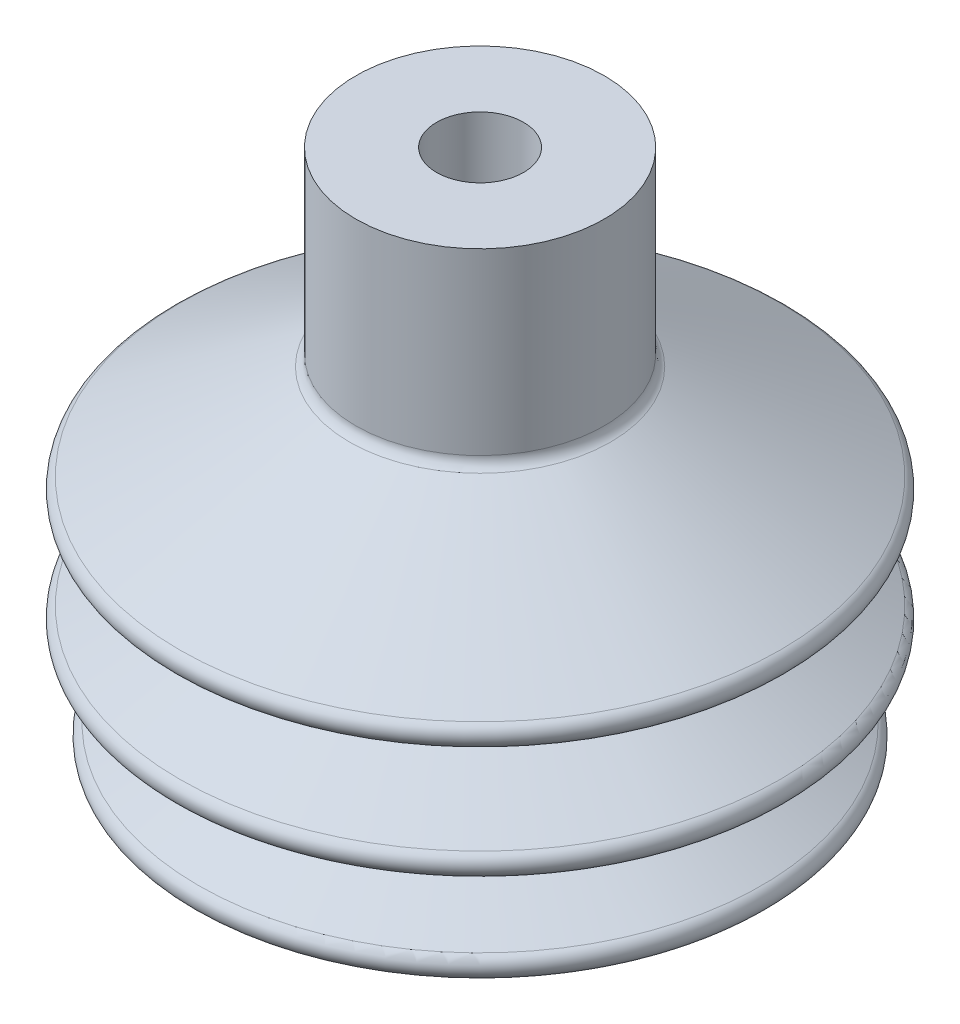
ISO-10303-21;
HEADER;
FILE_DESCRIPTION(('STEP AP214'),'2;1');
FILE_NAME('part.step','',(''),(''),'','','');
FILE_SCHEMA(('AUTOMOTIVE_DESIGN { 1 0 10303 214 1 1 1 1 }'));
ENDSEC;
DATA;
#1=APPLICATION_CONTEXT('core data for automotive mechanical design processes');
#2=APPLICATION_PROTOCOL_DEFINITION('international standard','automotive_design',2000,#1);
#3=PRODUCT_CONTEXT('',#1,'mechanical');
#4=PRODUCT('Part','Part','',(#3));
#5=PRODUCT_RELATED_PRODUCT_CATEGORY('part','',(#4));
#6=PRODUCT_DEFINITION_FORMATION('','',#4);
#7=PRODUCT_DEFINITION_CONTEXT('part definition',#1,'design');
#8=PRODUCT_DEFINITION('design','',#6,#7);
#9=PRODUCT_DEFINITION_SHAPE('','',#8);
#10=(LENGTH_UNIT() NAMED_UNIT(*) SI_UNIT(.MILLI.,.METRE.));
#11=(NAMED_UNIT(*) PLANE_ANGLE_UNIT() SI_UNIT($,.RADIAN.));
#12=(NAMED_UNIT(*) SI_UNIT($,.STERADIAN.) SOLID_ANGLE_UNIT());
#13=UNCERTAINTY_MEASURE_WITH_UNIT(LENGTH_MEASURE(1.E-05),#10,'distance_accuracy_value','');
#14=(GEOMETRIC_REPRESENTATION_CONTEXT(3) GLOBAL_UNCERTAINTY_ASSIGNED_CONTEXT((#13)) GLOBAL_UNIT_ASSIGNED_CONTEXT((#10,
#11,#12)) REPRESENTATION_CONTEXT('',''));
#15=CARTESIAN_POINT('',(0.,0.,0.));
#16=DIRECTION('',(0.,0.,1.));
#17=DIRECTION('',(1.,0.,0.));
#18=AXIS2_PLACEMENT_3D('',#15,#16,#17);
#19=CARTESIAN_POINT('',(0.,0.,0.));
#20=DIRECTION('',(0.,1.,0.));
#21=DIRECTION('',(0.,0.,1.));
#22=AXIS2_PLACEMENT_3D('',#19,#20,#21);
#23=PLANE('',#22);
#24=CARTESIAN_POINT('',(0.,0.,0.));
#25=DIRECTION('',(0.,1.,0.));
#26=DIRECTION('',(0.,0.,1.));
#27=AXIS2_PLACEMENT_3D('',#24,#25,#26);
#28=CIRCLE('',#27,3.5);
#29=CARTESIAN_POINT('',(0.,0.,3.5));
#30=VERTEX_POINT('',#29);
#31=EDGE_CURVE('E82',#30,#30,#28,.T.);
#32=ORIENTED_EDGE('',*,*,#31,.T.);
#33=EDGE_LOOP('',(#32));
#34=FACE_BOUND('',#33,.T.);
#35=CARTESIAN_POINT('',(0.,0.,0.));
#36=DIRECTION('',(0.,-1.,0.));
#37=DIRECTION('',(0.,0.,-1.));
#38=AXIS2_PLACEMENT_3D('',#35,#36,#37);
#39=CIRCLE('',#38,5.90880915825541);
#40=CARTESIAN_POINT('',(0.,0.,-5.90880915825541));
#41=VERTEX_POINT('',#40);
#42=EDGE_CURVE('E117',#41,#41,#39,.T.);
#43=ORIENTED_EDGE('',*,*,#42,.T.);
#44=EDGE_LOOP('',(#43));
#45=FACE_BOUND('',#44,.T.);
#46=ADVANCED_FACE('F37',(#34,#45),#23,.F.);
#47=CARTESIAN_POINT('',(0.,15.,0.));
#48=DIRECTION('',(0.,1.,0.));
#49=DIRECTION('',(0.,0.,1.));
#50=AXIS2_PLACEMENT_3D('',#47,#48,#49);
#51=PLANE('',#50);
#52=CARTESIAN_POINT('',(0.,15.,0.));
#53=DIRECTION('',(0.,1.,0.));
#54=DIRECTION('',(0.,0.,1.));
#55=AXIS2_PLACEMENT_3D('',#52,#53,#54);
#56=CIRCLE('',#55,10.);
#57=CARTESIAN_POINT('',(0.,15.,10.));
#58=VERTEX_POINT('',#57);
#59=EDGE_CURVE('E77',#58,#58,#56,.T.);
#60=ORIENTED_EDGE('',*,*,#59,.T.);
#61=EDGE_LOOP('',(#60));
#62=FACE_BOUND('',#61,.T.);
#63=CARTESIAN_POINT('',(0.,15.,0.));
#64=DIRECTION('',(0.,1.,0.));
#65=DIRECTION('',(0.,0.,1.));
#66=AXIS2_PLACEMENT_3D('',#63,#64,#65);
#67=CIRCLE('',#66,3.5);
#68=CARTESIAN_POINT('',(0.,15.,3.5));
#69=VERTEX_POINT('',#68);
#70=EDGE_CURVE('E81',#69,#69,#67,.T.);
#71=ORIENTED_EDGE('',*,*,#70,.F.);
#72=EDGE_LOOP('',(#71));
#73=FACE_BOUND('',#72,.T.);
#74=ADVANCED_FACE('F140',(#62,#73),#51,.T.);
#75=CARTESIAN_POINT('',(0.,15.,0.));
#76=DIRECTION('',(0.,-1.,0.));
#77=DIRECTION('',(0.,0.,-1.));
#78=AXIS2_PLACEMENT_3D('',#75,#76,#77);
#79=CYLINDRICAL_SURFACE('',#78,10.);
#80=CARTESIAN_POINT('',(0.,0.585929994802857,0.));
#81=DIRECTION('',(0.,-1.,0.));
#82=DIRECTION('',(0.,0.,-1.));
#83=AXIS2_PLACEMENT_3D('',#80,#81,#82);
#84=CIRCLE('',#83,10.);
#85=CARTESIAN_POINT('',(0.,0.585929994802857,-10.));
#86=VERTEX_POINT('',#85);
#87=EDGE_CURVE('E65',#86,#86,#84,.F.);
#88=ORIENTED_EDGE('',*,*,#87,.T.);
#89=EDGE_LOOP('',(#88));
#90=FACE_BOUND('',#89,.T.);
#91=ORIENTED_EDGE('',*,*,#59,.F.);
#92=EDGE_LOOP('',(#91));
#93=FACE_BOUND('',#92,.T.);
#94=ADVANCED_FACE('F146',(#90,#93),#79,.T.);
#95=CARTESIAN_POINT('',(0.,15.,0.));
#96=DIRECTION('',(0.,-1.,0.));
#97=DIRECTION('',(0.,0.,-1.));
#98=AXIS2_PLACEMENT_3D('',#95,#96,#97);
#99=CYLINDRICAL_SURFACE('',#98,3.5);
#100=ORIENTED_EDGE('',*,*,#70,.T.);
#101=EDGE_LOOP('',(#100));
#102=FACE_BOUND('',#101,.T.);
#103=ORIENTED_EDGE('',*,*,#31,.F.);
#104=EDGE_LOOP('',(#103));
#105=FACE_BOUND('',#104,.T.);
#106=ADVANCED_FACE('F152',(#102,#105),#99,.F.);
#107=CARTESIAN_POINT('',(0.,-8.96606826091942,0.));
#108=DIRECTION('',(0.,-1.,0.));
#109=DIRECTION('',(0.,0.,-1.));
#110=AXIS2_PLACEMENT_3D('',#107,#108,#109);
#111=CONICAL_SURFACE('',#110,26.,1.06001932873222);
#112=CARTESIAN_POINT('',(0.,-0.286434936656735,0.));
#113=DIRECTION('',(0.,1.,0.));
#114=DIRECTION('',(0.,0.,1.));
#115=AXIS2_PLACEMENT_3D('',#112,#113,#114);
#116=CIRCLE('',#115,10.5111447797563);
#117=CARTESIAN_POINT('',(0.,-0.286434936656735,10.5111447797563));
#118=VERTEX_POINT('',#117);
#119=EDGE_CURVE('E69',#118,#118,#116,.F.);
#120=ORIENTED_EDGE('',*,*,#119,.T.);
#121=EDGE_LOOP('',(#120));
#122=FACE_BOUND('',#121,.T.);
#123=CARTESIAN_POINT('',(0.,-7.94426354758497,0.));
#124=DIRECTION('',(0.,1.,0.));
#125=DIRECTION('',(0.,0.,1.));
#126=AXIS2_PLACEMENT_3D('',#123,#124,#125);
#127=CIRCLE('',#126,24.1765836554456);
#128=CARTESIAN_POINT('',(0.,-7.94426354758497,24.1765836554456));
#129=VERTEX_POINT('',#128);
#130=EDGE_CURVE('E73',#129,#129,#127,.T.);
#131=ORIENTED_EDGE('',*,*,#130,.T.);
#132=EDGE_LOOP('',(#131));
#133=FACE_BOUND('',#132,.T.);
#134=ADVANCED_FACE('F192',(#122,#133),#111,.T.);
#135=CARTESIAN_POINT('',(0.,-12.7292224881256,0.));
#136=DIRECTION('',(0.,1.,0.));
#137=DIRECTION('',(0.,0.,1.));
#138=AXIS2_PLACEMENT_3D('',#135,#136,#137);
#139=CONICAL_SURFACE('',#138,16.6245431295963,1.18909779745228);
#140=CARTESIAN_POINT('',(0.,-9.74466175602362,0.));
#141=DIRECTION('',(0.,-1.,0.));
#142=DIRECTION('',(0.,0.,-1.));
#143=AXIS2_PLACEMENT_3D('',#140,#141,#142);
#144=CIRCLE('',#143,24.0602257329364);
#145=CARTESIAN_POINT('',(0.,-9.74466175602362,-24.0602257329364));
#146=VERTEX_POINT('',#145);
#147=EDGE_CURVE('E10',#146,#146,#144,.T.);
#148=ORIENTED_EDGE('',*,*,#147,.T.);
#149=EDGE_LOOP('',(#148));
#150=FACE_BOUND('',#149,.T.);
#151=CARTESIAN_POINT('',(0.,-12.7292224881256,0.));
#152=DIRECTION('',(0.,-1.,0.));
#153=DIRECTION('',(0.,0.,-1.));
#154=AXIS2_PLACEMENT_3D('',#151,#152,#153);
#155=CIRCLE('',#154,16.6245431295963);
#156=CARTESIAN_POINT('',(0.,-12.7292224881256,-16.6245431295963));
#157=VERTEX_POINT('',#156);
#158=EDGE_CURVE('E86',#157,#157,#155,.T.);
#159=ORIENTED_EDGE('',*,*,#158,.F.);
#160=EDGE_LOOP('',(#159));
#161=FACE_BOUND('',#160,.T.);
#162=ADVANCED_FACE('F189',(#150,#161),#139,.T.);
#163=CARTESIAN_POINT('',(0.,-17.9830341304597,0.));
#164=DIRECTION('',(0.,-1.,0.));
#165=DIRECTION('',(0.,0.,-1.));
#166=AXIS2_PLACEMENT_3D('',#163,#164,#165);
#167=CONICAL_SURFACE('',#166,26.,1.06001932873222);
#168=CARTESIAN_POINT('',(0.,-16.9612294171253,0.));
#169=DIRECTION('',(0.,1.,0.));
#170=DIRECTION('',(0.,0.,1.));
#171=AXIS2_PLACEMENT_3D('',#168,#169,#170);
#172=CIRCLE('',#171,24.1765836554456);
#173=CARTESIAN_POINT('',(0.,-16.9612294171253,24.1765836554456));
#174=VERTEX_POINT('',#173);
#175=EDGE_CURVE('E45',#174,#174,#172,.T.);
#176=ORIENTED_EDGE('',*,*,#175,.T.);
#177=EDGE_LOOP('',(#176));
#178=FACE_BOUND('',#177,.T.);
#179=ORIENTED_EDGE('',*,*,#158,.T.);
#180=EDGE_LOOP('',(#179));
#181=FACE_BOUND('',#180,.T.);
#182=ADVANCED_FACE('F171',(#178,#181),#167,.T.);
#183=CARTESIAN_POINT('',(0.,-21.7461883576659,0.));
#184=DIRECTION('',(0.,1.,0.));
#185=DIRECTION('',(0.,0.,1.));
#186=AXIS2_PLACEMENT_3D('',#183,#184,#185);
#187=CONICAL_SURFACE('',#186,16.6245431295963,1.18909779745228);
#188=CARTESIAN_POINT('',(0.,-18.7616276255639,0.));
#189=DIRECTION('',(0.,-1.,0.));
#190=DIRECTION('',(0.,0.,-1.));
#191=AXIS2_PLACEMENT_3D('',#188,#189,#190);
#192=CIRCLE('',#191,24.0602257329364);
#193=CARTESIAN_POINT('',(0.,-18.7616276255639,-24.0602257329364));
#194=VERTEX_POINT('',#193);
#195=EDGE_CURVE('E50',#194,#194,#192,.T.);
#196=ORIENTED_EDGE('',*,*,#195,.T.);
#197=EDGE_LOOP('',(#196));
#198=FACE_BOUND('',#197,.T.);
#199=CARTESIAN_POINT('',(0.,-21.7461883576659,0.));
#200=DIRECTION('',(0.,-1.,0.));
#201=DIRECTION('',(0.,0.,-1.));
#202=AXIS2_PLACEMENT_3D('',#199,#200,#201);
#203=CIRCLE('',#202,16.6245431295963);
#204=CARTESIAN_POINT('',(0.,-21.7461883576659,-16.6245431295963));
#205=VERTEX_POINT('',#204);
#206=EDGE_CURVE('E93',#205,#205,#203,.T.);
#207=ORIENTED_EDGE('',*,*,#206,.F.);
#208=EDGE_LOOP('',(#207));
#209=FACE_BOUND('',#208,.T.);
#210=ADVANCED_FACE('F167',(#198,#209),#187,.T.);
#211=CARTESIAN_POINT('',(0.,-27.,0.));
#212=DIRECTION('',(0.,-1.,0.));
#213=DIRECTION('',(0.,0.,-1.));
#214=AXIS2_PLACEMENT_3D('',#211,#212,#213);
#215=CONICAL_SURFACE('',#214,26.,1.06001932873222);
#216=CARTESIAN_POINT('',(0.,-25.1276350685404,0.));
#217=DIRECTION('',(0.,1.,0.));
#218=DIRECTION('',(0.,0.,1.));
#219=AXIS2_PLACEMENT_3D('',#216,#217,#218);
#220=CIRCLE('',#219,22.6587540902481);
#221=CARTESIAN_POINT('',(0.,-25.1276350685404,22.6587540902481));
#222=VERTEX_POINT('',#221);
#223=EDGE_CURVE('E55',#222,#222,#220,.T.);
#224=ORIENTED_EDGE('',*,*,#223,.T.);
#225=EDGE_LOOP('',(#224));
#226=FACE_BOUND('',#225,.T.);
#227=ORIENTED_EDGE('',*,*,#206,.T.);
#228=EDGE_LOOP('',(#227));
#229=FACE_BOUND('',#228,.T.);
#230=ADVANCED_FACE('F170',(#226,#229),#215,.T.);
#231=CARTESIAN_POINT('',(26.,-27.,0.));
#232=DIRECTION('',(0.,-1.,0.));
#233=DIRECTION('',(0.,0.,-1.));
#234=AXIS2_PLACEMENT_3D('',#231,#232,#233);
#235=PLANE('',#234);
#236=CARTESIAN_POINT('',(0.,-27.,0.));
#237=DIRECTION('',(0.,-1.,0.));
#238=DIRECTION('',(0.,0.,-1.));
#239=AXIS2_PLACEMENT_3D('',#236,#237,#238);
#240=CIRCLE('',#239,22.1698988700044);
#241=CARTESIAN_POINT('',(0.,-27.,-22.1698988700044));
#242=VERTEX_POINT('',#241);
#243=EDGE_CURVE('E61',#242,#242,#240,.T.);
#244=ORIENTED_EDGE('',*,*,#243,.T.);
#245=EDGE_LOOP('',(#244));
#246=FACE_BOUND('',#245,.T.);
#247=CARTESIAN_POINT('',(0.,-27.,0.));
#248=DIRECTION('',(0.,-1.,0.));
#249=DIRECTION('',(0.,0.,-1.));
#250=AXIS2_PLACEMENT_3D('',#247,#248,#249);
#251=CIRCLE('',#250,21.9088091582554);
#252=CARTESIAN_POINT('',(0.,-27.,-21.9088091582554));
#253=VERTEX_POINT('',#252);
#254=EDGE_CURVE('E97',#253,#253,#251,.T.);
#255=ORIENTED_EDGE('',*,*,#254,.F.);
#256=EDGE_LOOP('',(#255));
#257=FACE_BOUND('',#256,.T.);
#258=ADVANCED_FACE('F176',(#246,#257),#235,.T.);
#259=CARTESIAN_POINT('',(0.,-21.4473087939162,0.));
#260=DIRECTION('',(0.,-1.,0.));
#261=DIRECTION('',(0.,0.,-1.));
#262=AXIS2_PLACEMENT_3D('',#259,#260,#261);
#263=CONICAL_SURFACE('',#262,12.,1.06001932873222);
#264=ORIENTED_EDGE('',*,*,#254,.T.);
#265=EDGE_LOOP('',(#264));
#266=FACE_BOUND('',#265,.T.);
#267=CARTESIAN_POINT('',(0.,-21.4473087939162,0.));
#268=DIRECTION('',(0.,-1.,0.));
#269=DIRECTION('',(0.,0.,-1.));
#270=AXIS2_PLACEMENT_3D('',#267,#268,#269);
#271=CIRCLE('',#270,12.);
#272=CARTESIAN_POINT('',(0.,-21.4473087939162,-12.));
#273=VERTEX_POINT('',#272);
#274=EDGE_CURVE('E101',#273,#273,#271,.T.);
#275=ORIENTED_EDGE('',*,*,#274,.F.);
#276=EDGE_LOOP('',(#275));
#277=FACE_BOUND('',#276,.T.);
#278=ADVANCED_FACE('F182',(#266,#277),#263,.F.);
#279=CARTESIAN_POINT('',(0.,-17.68415456671,0.));
#280=DIRECTION('',(0.,1.,0.));
#281=DIRECTION('',(0.,0.,1.));
#282=AXIS2_PLACEMENT_3D('',#279,#280,#281);
#283=CONICAL_SURFACE('',#282,21.3754568704037,1.18909779745228);
#284=ORIENTED_EDGE('',*,*,#274,.T.);
#285=EDGE_LOOP('',(#284));
#286=FACE_BOUND('',#285,.T.);
#287=CARTESIAN_POINT('',(0.,-17.68415456671,0.));
#288=DIRECTION('',(0.,-1.,0.));
#289=DIRECTION('',(0.,0.,-1.));
#290=AXIS2_PLACEMENT_3D('',#287,#288,#289);
#291=CIRCLE('',#290,21.3754568704037);
#292=CARTESIAN_POINT('',(0.,-17.68415456671,-21.3754568704037));
#293=VERTEX_POINT('',#292);
#294=EDGE_CURVE('E105',#293,#293,#291,.T.);
#295=ORIENTED_EDGE('',*,*,#294,.F.);
#296=EDGE_LOOP('',(#295));
#297=FACE_BOUND('',#296,.T.);
#298=ADVANCED_FACE('F275',(#286,#297),#283,.F.);
#299=CARTESIAN_POINT('',(0.,-12.4303429243759,0.));
#300=DIRECTION('',(0.,-1.,0.));
#301=DIRECTION('',(0.,0.,-1.));
#302=AXIS2_PLACEMENT_3D('',#299,#300,#301);
#303=CONICAL_SURFACE('',#302,12.,1.06001932873222);
#304=ORIENTED_EDGE('',*,*,#294,.T.);
#305=EDGE_LOOP('',(#304));
#306=FACE_BOUND('',#305,.T.);
#307=CARTESIAN_POINT('',(0.,-12.4303429243759,0.));
#308=DIRECTION('',(0.,-1.,0.));
#309=DIRECTION('',(0.,0.,-1.));
#310=AXIS2_PLACEMENT_3D('',#307,#308,#309);
#311=CIRCLE('',#310,12.);
#312=CARTESIAN_POINT('',(0.,-12.4303429243759,-12.));
#313=VERTEX_POINT('',#312);
#314=EDGE_CURVE('E109',#313,#313,#311,.T.);
#315=ORIENTED_EDGE('',*,*,#314,.F.);
#316=EDGE_LOOP('',(#315));
#317=FACE_BOUND('',#316,.T.);
#318=ADVANCED_FACE('F136',(#306,#317),#303,.F.);
#319=CARTESIAN_POINT('',(0.,-8.66718869716969,0.));
#320=DIRECTION('',(0.,1.,0.));
#321=DIRECTION('',(0.,0.,1.));
#322=AXIS2_PLACEMENT_3D('',#319,#320,#321);
#323=CONICAL_SURFACE('',#322,21.3754568704037,1.18909779745228);
#324=ORIENTED_EDGE('',*,*,#314,.T.);
#325=EDGE_LOOP('',(#324));
#326=FACE_BOUND('',#325,.T.);
#327=CARTESIAN_POINT('',(0.,-8.66718869716969,0.));
#328=DIRECTION('',(0.,-1.,0.));
#329=DIRECTION('',(0.,0.,-1.));
#330=AXIS2_PLACEMENT_3D('',#327,#328,#329);
#331=CIRCLE('',#330,21.3754568704037);
#332=CARTESIAN_POINT('',(0.,-8.66718869716969,-21.3754568704037));
#333=VERTEX_POINT('',#332);
#334=EDGE_CURVE('E113',#333,#333,#331,.T.);
#335=ORIENTED_EDGE('',*,*,#334,.F.);
#336=EDGE_LOOP('',(#335));
#337=FACE_BOUND('',#336,.T.);
#338=ADVANCED_FACE('F126',(#326,#337),#323,.F.);
#339=CARTESIAN_POINT('',(0.,0.,0.));
#340=DIRECTION('',(0.,-1.,0.));
#341=DIRECTION('',(0.,0.,-1.));
#342=AXIS2_PLACEMENT_3D('',#339,#340,#341);
#343=CONICAL_SURFACE('',#342,5.90880915825541,1.06001932873222);
#344=ORIENTED_EDGE('',*,*,#334,.T.);
#345=EDGE_LOOP('',(#344));
#346=FACE_BOUND('',#345,.T.);
#347=ORIENTED_EDGE('',*,*,#42,.F.);
#348=EDGE_LOOP('',(#347));
#349=FACE_BOUND('',#348,.T.);
#350=ADVANCED_FACE('F123',(#346,#349),#343,.F.);
#351=CARTESIAN_POINT('',(0.,0.585929994802857,0.));
#352=DIRECTION('',(0.,-1.,0.));
#353=DIRECTION('',(0.,0.,-1.));
#354=AXIS2_PLACEMENT_3D('',#351,#352,#353);
#355=TOROIDAL_SURFACE('',#354,11.,1.);
#356=ORIENTED_EDGE('',*,*,#87,.F.);
#357=EDGE_LOOP('',(#356));
#358=FACE_BOUND('',#357,.T.);
#359=ORIENTED_EDGE('',*,*,#119,.F.);
#360=EDGE_LOOP('',(#359));
#361=FACE_BOUND('',#360,.T.);
#362=ADVANCED_FACE('F125',(#358,#361),#355,.F.);
#363=CARTESIAN_POINT('',(0.,-26.,0.));
#364=DIRECTION('',(0.,-1.,0.));
#365=DIRECTION('',(0.,0.,-1.));
#366=AXIS2_PLACEMENT_3D('',#363,#364,#365);
#367=TOROIDAL_SURFACE('',#366,22.1698988700044,1.);
#368=ORIENTED_EDGE('',*,*,#223,.F.);
#369=EDGE_LOOP('',(#368));
#370=FACE_BOUND('',#369,.T.);
#371=ORIENTED_EDGE('',*,*,#243,.F.);
#372=EDGE_LOOP('',(#371));
#373=FACE_BOUND('',#372,.T.);
#374=ADVANCED_FACE('F133',(#370,#373),#367,.T.);
#375=CARTESIAN_POINT('',(0.,-17.8335943485848,0.));
#376=DIRECTION('',(0.,1.,0.));
#377=DIRECTION('',(0.,0.,1.));
#378=AXIS2_PLACEMENT_3D('',#375,#376,#377);
#379=TOROIDAL_SURFACE('',#378,23.6877284352019,1.);
#380=ORIENTED_EDGE('',*,*,#175,.F.);
#381=EDGE_LOOP('',(#380));
#382=FACE_BOUND('',#381,.T.);
#383=ORIENTED_EDGE('',*,*,#195,.F.);
#384=EDGE_LOOP('',(#383));
#385=FACE_BOUND('',#384,.T.);
#386=ADVANCED_FACE('F156',(#382,#385),#379,.T.);
#387=CARTESIAN_POINT('',(0.,-8.81662847904455,0.));
#388=DIRECTION('',(0.,1.,0.));
#389=DIRECTION('',(0.,0.,1.));
#390=AXIS2_PLACEMENT_3D('',#387,#388,#389);
#391=TOROIDAL_SURFACE('',#390,23.6877284352019,1.);
#392=ORIENTED_EDGE('',*,*,#130,.F.);
#393=EDGE_LOOP('',(#392));
#394=FACE_BOUND('',#393,.T.);
#395=ORIENTED_EDGE('',*,*,#147,.F.);
#396=EDGE_LOOP('',(#395));
#397=FACE_BOUND('',#396,.T.);
#398=ADVANCED_FACE('F39',(#394,#397),#391,.T.);
#399=CLOSED_SHELL('',(#46,#74,#94,#106,#134,#162,#182,#210,#230,#258,#278,#298,#318,#338,#350,
#362,#374,#386,#398));
#400=MANIFOLD_SOLID_BREP('B2',#399);
#401=ADVANCED_BREP_SHAPE_REPRESENTATION('',(#18,#400),#14);
#402=SHAPE_DEFINITION_REPRESENTATION(#9,#401);
ENDSEC;
END-ISO-10303-21;
